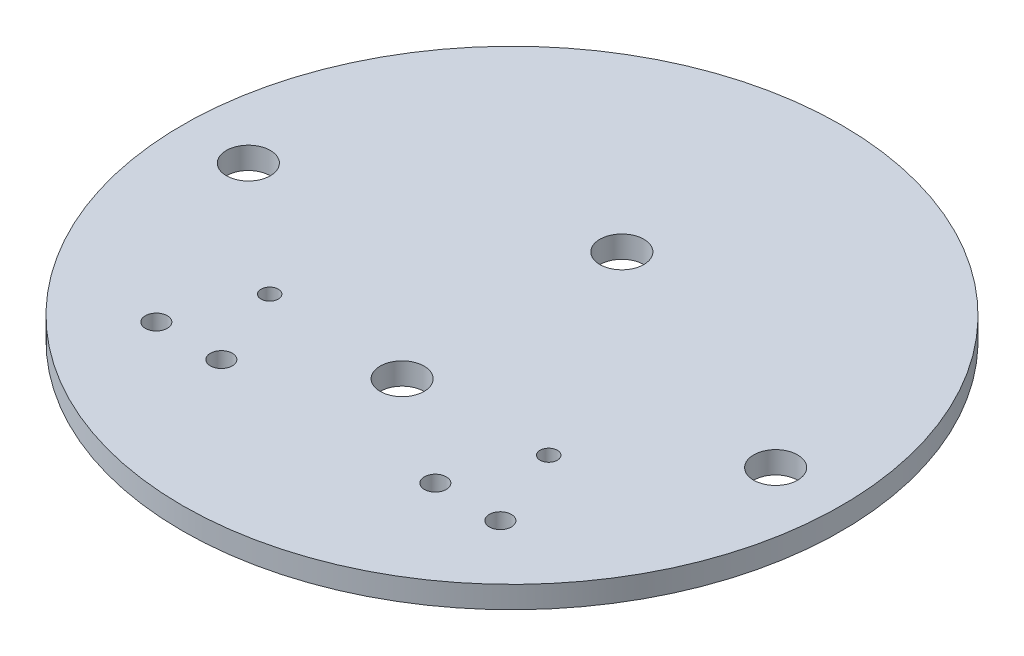
ISO-10303-21;
HEADER;
FILE_DESCRIPTION(('STEP AP214'),'2;1');
FILE_NAME('part.step','',(''),(''),'','','');
FILE_SCHEMA(('AUTOMOTIVE_DESIGN { 1 0 10303 214 1 1 1 1 }'));
ENDSEC;
DATA;
#1=APPLICATION_CONTEXT('core data for automotive mechanical design processes');
#2=APPLICATION_PROTOCOL_DEFINITION('international standard','automotive_design',2000,#1);
#3=PRODUCT_CONTEXT('',#1,'mechanical');
#4=PRODUCT('Part','Part','',(#3));
#5=PRODUCT_RELATED_PRODUCT_CATEGORY('part','',(#4));
#6=PRODUCT_DEFINITION_FORMATION('','',#4);
#7=PRODUCT_DEFINITION_CONTEXT('part definition',#1,'design');
#8=PRODUCT_DEFINITION('design','',#6,#7);
#9=PRODUCT_DEFINITION_SHAPE('','',#8);
#10=(LENGTH_UNIT() NAMED_UNIT(*) SI_UNIT(.MILLI.,.METRE.));
#11=(NAMED_UNIT(*) PLANE_ANGLE_UNIT() SI_UNIT($,.RADIAN.));
#12=(NAMED_UNIT(*) SI_UNIT($,.STERADIAN.) SOLID_ANGLE_UNIT());
#13=UNCERTAINTY_MEASURE_WITH_UNIT(LENGTH_MEASURE(1.E-05),#10,'distance_accuracy_value','');
#14=(GEOMETRIC_REPRESENTATION_CONTEXT(3) GLOBAL_UNCERTAINTY_ASSIGNED_CONTEXT((#13)) GLOBAL_UNIT_ASSIGNED_CONTEXT((#10,
#11,#12)) REPRESENTATION_CONTEXT('',''));
#15=CARTESIAN_POINT('',(0.,0.,0.));
#16=DIRECTION('',(0.,0.,1.));
#17=DIRECTION('',(1.,0.,0.));
#18=AXIS2_PLACEMENT_3D('',#15,#16,#17);
#19=CARTESIAN_POINT('',(0.,3.175,0.));
#20=DIRECTION('',(0.,-1.,0.));
#21=DIRECTION('',(0.,0.,-1.));
#22=AXIS2_PLACEMENT_3D('',#19,#20,#21);
#23=CYLINDRICAL_SURFACE('',#22,47.625);
#24=CARTESIAN_POINT('',(0.,3.175,0.));
#25=DIRECTION('',(0.,1.,0.));
#26=DIRECTION('',(0.,0.,1.));
#27=AXIS2_PLACEMENT_3D('',#24,#25,#26);
#28=CIRCLE('',#27,47.625);
#29=CARTESIAN_POINT('',(0.,3.175,47.625));
#30=VERTEX_POINT('',#29);
#31=EDGE_CURVE('E10',#30,#30,#28,.T.);
#32=ORIENTED_EDGE('',*,*,#31,.F.);
#33=EDGE_LOOP('',(#32));
#34=FACE_BOUND('',#33,.T.);
#35=CARTESIAN_POINT('',(0.,0.,0.));
#36=DIRECTION('',(0.,1.,0.));
#37=DIRECTION('',(0.,0.,1.));
#38=AXIS2_PLACEMENT_3D('',#35,#36,#37);
#39=CIRCLE('',#38,47.625);
#40=CARTESIAN_POINT('',(0.,0.,47.625));
#41=VERTEX_POINT('',#40);
#42=EDGE_CURVE('E37',#41,#41,#39,.T.);
#43=ORIENTED_EDGE('',*,*,#42,.T.);
#44=EDGE_LOOP('',(#43));
#45=FACE_BOUND('',#44,.T.);
#46=ADVANCED_FACE('F30',(#34,#45),#23,.T.);
#47=CARTESIAN_POINT('',(0.,3.175,0.));
#48=DIRECTION('',(0.,1.,0.));
#49=DIRECTION('',(0.,0.,1.));
#50=AXIS2_PLACEMENT_3D('',#47,#48,#49);
#51=PLANE('',#50);
#52=CARTESIAN_POINT('',(-24.86025,3.175,26.5429999999999));
#53=DIRECTION('',(0.,1.,0.));
#54=DIRECTION('',(0.,0.,1.));
#55=AXIS2_PLACEMENT_3D('',#52,#53,#54);
#56=CIRCLE('',#55,1.5875);
#57=CARTESIAN_POINT('',(-24.86025,3.175,28.1304999999999));
#58=VERTEX_POINT('',#57);
#59=EDGE_CURVE('E59',#58,#58,#56,.T.);
#60=ORIENTED_EDGE('',*,*,#59,.F.);
#61=EDGE_LOOP('',(#60));
#62=FACE_BOUND('',#61,.T.);
#63=CARTESIAN_POINT('',(-15.46225,3.175,26.5429999999999));
#64=DIRECTION('',(0.,1.,0.));
#65=DIRECTION('',(0.,0.,1.));
#66=AXIS2_PLACEMENT_3D('',#63,#64,#65);
#67=CIRCLE('',#66,1.5875);
#68=CARTESIAN_POINT('',(-15.46225,3.175,28.1304999999999));
#69=VERTEX_POINT('',#68);
#70=EDGE_CURVE('E80',#69,#69,#67,.T.);
#71=ORIENTED_EDGE('',*,*,#70,.F.);
#72=EDGE_LOOP('',(#71));
#73=FACE_BOUND('',#72,.T.);
#74=CARTESIAN_POINT('',(15.46225,3.175,26.5429999999999));
#75=DIRECTION('',(0.,1.,0.));
#76=DIRECTION('',(0.,0.,1.));
#77=AXIS2_PLACEMENT_3D('',#74,#75,#76);
#78=CIRCLE('',#77,1.5875);
#79=CARTESIAN_POINT('',(15.46225,3.175,28.1304999999999));
#80=VERTEX_POINT('',#79);
#81=EDGE_CURVE('E77',#80,#80,#78,.T.);
#82=ORIENTED_EDGE('',*,*,#81,.F.);
#83=EDGE_LOOP('',(#82));
#84=FACE_BOUND('',#83,.T.);
#85=CARTESIAN_POINT('',(24.86025,3.175,26.5429999999999));
#86=DIRECTION('',(0.,1.,0.));
#87=DIRECTION('',(0.,0.,1.));
#88=AXIS2_PLACEMENT_3D('',#85,#86,#87);
#89=CIRCLE('',#88,1.5875);
#90=CARTESIAN_POINT('',(24.86025,3.175,28.1304999999999));
#91=VERTEX_POINT('',#90);
#92=EDGE_CURVE('E74',#91,#91,#89,.T.);
#93=ORIENTED_EDGE('',*,*,#92,.F.);
#94=EDGE_LOOP('',(#93));
#95=FACE_BOUND('',#94,.T.);
#96=CARTESIAN_POINT('',(20.16125,3.175,14.859));
#97=DIRECTION('',(0.,1.,0.));
#98=DIRECTION('',(0.,0.,1.));
#99=AXIS2_PLACEMENT_3D('',#96,#97,#98);
#100=CIRCLE('',#99,1.25);
#101=CARTESIAN_POINT('',(20.16125,3.175,16.109));
#102=VERTEX_POINT('',#101);
#103=EDGE_CURVE('E70',#102,#102,#100,.T.);
#104=ORIENTED_EDGE('',*,*,#103,.F.);
#105=EDGE_LOOP('',(#104));
#106=FACE_BOUND('',#105,.T.);
#107=CARTESIAN_POINT('',(-20.16125,3.175,14.8589999999999));
#108=DIRECTION('',(0.,1.,0.));
#109=DIRECTION('',(0.,0.,1.));
#110=AXIS2_PLACEMENT_3D('',#107,#108,#109);
#111=CIRCLE('',#110,1.25);
#112=CARTESIAN_POINT('',(-20.16125,3.175,16.1089999999999));
#113=VERTEX_POINT('',#112);
#114=EDGE_CURVE('E66',#113,#113,#111,.T.);
#115=ORIENTED_EDGE('',*,*,#114,.F.);
#116=EDGE_LOOP('',(#115));
#117=FACE_BOUND('',#116,.T.);
#118=CARTESIAN_POINT('',(0.,3.175,15.875));
#119=DIRECTION('',(0.,1.,0.));
#120=DIRECTION('',(0.,0.,1.));
#121=AXIS2_PLACEMENT_3D('',#118,#119,#120);
#122=CIRCLE('',#121,3.175);
#123=CARTESIAN_POINT('',(0.,3.175,19.05));
#124=VERTEX_POINT('',#123);
#125=EDGE_CURVE('E51',#124,#124,#122,.T.);
#126=ORIENTED_EDGE('',*,*,#125,.F.);
#127=EDGE_LOOP('',(#126));
#128=FACE_BOUND('',#127,.T.);
#129=CARTESIAN_POINT('',(0.,3.175,-15.875));
#130=DIRECTION('',(0.,1.,0.));
#131=DIRECTION('',(0.,0.,1.));
#132=AXIS2_PLACEMENT_3D('',#129,#130,#131);
#133=CIRCLE('',#132,3.175);
#134=CARTESIAN_POINT('',(0.,3.175,-12.7));
#135=VERTEX_POINT('',#134);
#136=EDGE_CURVE('E58',#135,#135,#133,.T.);
#137=ORIENTED_EDGE('',*,*,#136,.F.);
#138=EDGE_LOOP('',(#137));
#139=FACE_BOUND('',#138,.T.);
#140=CARTESIAN_POINT('',(38.1,3.175,0.));
#141=DIRECTION('',(0.,1.,0.));
#142=DIRECTION('',(0.,0.,1.));
#143=AXIS2_PLACEMENT_3D('',#140,#141,#142);
#144=CIRCLE('',#143,3.175);
#145=CARTESIAN_POINT('',(38.1,3.175,3.17499999999998));
#146=VERTEX_POINT('',#145);
#147=EDGE_CURVE('E42',#146,#146,#144,.T.);
#148=ORIENTED_EDGE('',*,*,#147,.F.);
#149=EDGE_LOOP('',(#148));
#150=FACE_BOUND('',#149,.T.);
#151=CARTESIAN_POINT('',(-38.1,3.175,0.));
#152=DIRECTION('',(0.,1.,0.));
#153=DIRECTION('',(0.,0.,1.));
#154=AXIS2_PLACEMENT_3D('',#151,#152,#153);
#155=CIRCLE('',#154,3.175);
#156=CARTESIAN_POINT('',(-38.1,3.175,3.17500000000001));
#157=VERTEX_POINT('',#156);
#158=EDGE_CURVE('E50',#157,#157,#155,.T.);
#159=ORIENTED_EDGE('',*,*,#158,.F.);
#160=EDGE_LOOP('',(#159));
#161=FACE_BOUND('',#160,.T.);
#162=ORIENTED_EDGE('',*,*,#31,.T.);
#163=EDGE_LOOP('',(#162));
#164=FACE_BOUND('',#163,.T.);
#165=ADVANCED_FACE('F103',(#62,#73,#84,#95,#106,#117,#128,#139,#150,#161,#164),#51,.T.);
#166=CARTESIAN_POINT('',(0.,0.,0.));
#167=DIRECTION('',(0.,1.,0.));
#168=DIRECTION('',(0.,0.,1.));
#169=AXIS2_PLACEMENT_3D('',#166,#167,#168);
#170=PLANE('',#169);
#171=CARTESIAN_POINT('',(-24.86025,0.,26.5429999999999));
#172=DIRECTION('',(0.,1.,0.));
#173=DIRECTION('',(0.,0.,1.));
#174=AXIS2_PLACEMENT_3D('',#171,#172,#173);
#175=CIRCLE('',#174,1.5875);
#176=CARTESIAN_POINT('',(-24.86025,0.,28.1304999999999));
#177=VERTEX_POINT('',#176);
#178=EDGE_CURVE('E33',#177,#177,#175,.T.);
#179=ORIENTED_EDGE('',*,*,#178,.T.);
#180=EDGE_LOOP('',(#179));
#181=FACE_BOUND('',#180,.T.);
#182=CARTESIAN_POINT('',(-15.46225,0.,26.5429999999999));
#183=DIRECTION('',(0.,1.,0.));
#184=DIRECTION('',(0.,0.,1.));
#185=AXIS2_PLACEMENT_3D('',#182,#183,#184);
#186=CIRCLE('',#185,1.5875);
#187=CARTESIAN_POINT('',(-15.46225,0.,28.1304999999999));
#188=VERTEX_POINT('',#187);
#189=EDGE_CURVE('E78',#188,#188,#186,.T.);
#190=ORIENTED_EDGE('',*,*,#189,.T.);
#191=EDGE_LOOP('',(#190));
#192=FACE_BOUND('',#191,.T.);
#193=CARTESIAN_POINT('',(15.46225,0.,26.5429999999999));
#194=DIRECTION('',(0.,1.,0.));
#195=DIRECTION('',(0.,0.,1.));
#196=AXIS2_PLACEMENT_3D('',#193,#194,#195);
#197=CIRCLE('',#196,1.5875);
#198=CARTESIAN_POINT('',(15.46225,0.,28.1304999999999));
#199=VERTEX_POINT('',#198);
#200=EDGE_CURVE('E75',#199,#199,#197,.T.);
#201=ORIENTED_EDGE('',*,*,#200,.T.);
#202=EDGE_LOOP('',(#201));
#203=FACE_BOUND('',#202,.T.);
#204=CARTESIAN_POINT('',(24.86025,0.,26.5429999999999));
#205=DIRECTION('',(0.,1.,0.));
#206=DIRECTION('',(0.,0.,1.));
#207=AXIS2_PLACEMENT_3D('',#204,#205,#206);
#208=CIRCLE('',#207,1.5875);
#209=CARTESIAN_POINT('',(24.86025,0.,28.1304999999999));
#210=VERTEX_POINT('',#209);
#211=EDGE_CURVE('E71',#210,#210,#208,.T.);
#212=ORIENTED_EDGE('',*,*,#211,.T.);
#213=EDGE_LOOP('',(#212));
#214=FACE_BOUND('',#213,.T.);
#215=CARTESIAN_POINT('',(20.16125,0.,14.859));
#216=DIRECTION('',(0.,1.,0.));
#217=DIRECTION('',(0.,0.,1.));
#218=AXIS2_PLACEMENT_3D('',#215,#216,#217);
#219=CIRCLE('',#218,1.25);
#220=CARTESIAN_POINT('',(20.16125,0.,16.109));
#221=VERTEX_POINT('',#220);
#222=EDGE_CURVE('E67',#221,#221,#219,.T.);
#223=ORIENTED_EDGE('',*,*,#222,.T.);
#224=EDGE_LOOP('',(#223));
#225=FACE_BOUND('',#224,.T.);
#226=CARTESIAN_POINT('',(-20.16125,0.,14.8589999999999));
#227=DIRECTION('',(0.,1.,0.));
#228=DIRECTION('',(0.,0.,1.));
#229=AXIS2_PLACEMENT_3D('',#226,#227,#228);
#230=CIRCLE('',#229,1.25);
#231=CARTESIAN_POINT('',(-20.16125,0.,16.1089999999999));
#232=VERTEX_POINT('',#231);
#233=EDGE_CURVE('E63',#232,#232,#230,.T.);
#234=ORIENTED_EDGE('',*,*,#233,.T.);
#235=EDGE_LOOP('',(#234));
#236=FACE_BOUND('',#235,.T.);
#237=CARTESIAN_POINT('',(0.,0.,15.875));
#238=DIRECTION('',(0.,1.,0.));
#239=DIRECTION('',(0.,0.,1.));
#240=AXIS2_PLACEMENT_3D('',#237,#238,#239);
#241=CIRCLE('',#240,3.175);
#242=CARTESIAN_POINT('',(0.,0.,19.05));
#243=VERTEX_POINT('',#242);
#244=EDGE_CURVE('E60',#243,#243,#241,.T.);
#245=ORIENTED_EDGE('',*,*,#244,.T.);
#246=EDGE_LOOP('',(#245));
#247=FACE_BOUND('',#246,.T.);
#248=CARTESIAN_POINT('',(0.,0.,-15.875));
#249=DIRECTION('',(0.,1.,0.));
#250=DIRECTION('',(0.,0.,1.));
#251=AXIS2_PLACEMENT_3D('',#248,#249,#250);
#252=CIRCLE('',#251,3.175);
#253=CARTESIAN_POINT('',(0.,0.,-12.7));
#254=VERTEX_POINT('',#253);
#255=EDGE_CURVE('E55',#254,#254,#252,.T.);
#256=ORIENTED_EDGE('',*,*,#255,.T.);
#257=EDGE_LOOP('',(#256));
#258=FACE_BOUND('',#257,.T.);
#259=CARTESIAN_POINT('',(38.1,0.,0.));
#260=DIRECTION('',(0.,1.,0.));
#261=DIRECTION('',(0.,0.,1.));
#262=AXIS2_PLACEMENT_3D('',#259,#260,#261);
#263=CIRCLE('',#262,3.175);
#264=CARTESIAN_POINT('',(38.1,0.,3.17499999999998));
#265=VERTEX_POINT('',#264);
#266=EDGE_CURVE('E52',#265,#265,#263,.T.);
#267=ORIENTED_EDGE('',*,*,#266,.T.);
#268=EDGE_LOOP('',(#267));
#269=FACE_BOUND('',#268,.T.);
#270=CARTESIAN_POINT('',(-38.1,0.,0.));
#271=DIRECTION('',(0.,1.,0.));
#272=DIRECTION('',(0.,0.,1.));
#273=AXIS2_PLACEMENT_3D('',#270,#271,#272);
#274=CIRCLE('',#273,3.175);
#275=CARTESIAN_POINT('',(-38.1,0.,3.17500000000001));
#276=VERTEX_POINT('',#275);
#277=EDGE_CURVE('E47',#276,#276,#274,.T.);
#278=ORIENTED_EDGE('',*,*,#277,.T.);
#279=EDGE_LOOP('',(#278));
#280=FACE_BOUND('',#279,.T.);
#281=ORIENTED_EDGE('',*,*,#42,.F.);
#282=EDGE_LOOP('',(#281));
#283=FACE_BOUND('',#282,.T.);
#284=ADVANCED_FACE('F105',(#181,#192,#203,#214,#225,#236,#247,#258,#269,#280,#283),#170,.F.);
#285=CARTESIAN_POINT('',(-38.1,-31.623,0.));
#286=DIRECTION('',(0.,1.,0.));
#287=DIRECTION('',(0.,0.,1.));
#288=AXIS2_PLACEMENT_3D('',#285,#286,#287);
#289=CYLINDRICAL_SURFACE('',#288,3.175);
#290=ORIENTED_EDGE('',*,*,#158,.T.);
#291=EDGE_LOOP('',(#290));
#292=FACE_BOUND('',#291,.T.);
#293=ORIENTED_EDGE('',*,*,#277,.F.);
#294=EDGE_LOOP('',(#293));
#295=FACE_BOUND('',#294,.T.);
#296=ADVANCED_FACE('F100',(#292,#295),#289,.F.);
#297=CARTESIAN_POINT('',(38.1,-31.623,0.));
#298=DIRECTION('',(0.,1.,0.));
#299=DIRECTION('',(0.,0.,1.));
#300=AXIS2_PLACEMENT_3D('',#297,#298,#299);
#301=CYLINDRICAL_SURFACE('',#300,3.175);
#302=ORIENTED_EDGE('',*,*,#147,.T.);
#303=EDGE_LOOP('',(#302));
#304=FACE_BOUND('',#303,.T.);
#305=ORIENTED_EDGE('',*,*,#266,.F.);
#306=EDGE_LOOP('',(#305));
#307=FACE_BOUND('',#306,.T.);
#308=ADVANCED_FACE('F120',(#304,#307),#301,.F.);
#309=CARTESIAN_POINT('',(0.,22.225,-15.875));
#310=DIRECTION('',(0.,-1.,0.));
#311=DIRECTION('',(0.,0.,-1.));
#312=AXIS2_PLACEMENT_3D('',#309,#310,#311);
#313=CYLINDRICAL_SURFACE('',#312,3.175);
#314=ORIENTED_EDGE('',*,*,#136,.T.);
#315=EDGE_LOOP('',(#314));
#316=FACE_BOUND('',#315,.T.);
#317=ORIENTED_EDGE('',*,*,#255,.F.);
#318=EDGE_LOOP('',(#317));
#319=FACE_BOUND('',#318,.T.);
#320=ADVANCED_FACE('F123',(#316,#319),#313,.F.);
#321=CARTESIAN_POINT('',(0.,22.225,15.875));
#322=DIRECTION('',(0.,-1.,0.));
#323=DIRECTION('',(0.,0.,-1.));
#324=AXIS2_PLACEMENT_3D('',#321,#322,#323);
#325=CYLINDRICAL_SURFACE('',#324,3.175);
#326=ORIENTED_EDGE('',*,*,#125,.T.);
#327=EDGE_LOOP('',(#326));
#328=FACE_BOUND('',#327,.T.);
#329=ORIENTED_EDGE('',*,*,#244,.F.);
#330=EDGE_LOOP('',(#329));
#331=FACE_BOUND('',#330,.T.);
#332=ADVANCED_FACE('F127',(#328,#331),#325,.F.);
#333=CARTESIAN_POINT('',(-20.16125,47.625,14.8589999999999));
#334=DIRECTION('',(0.,-1.,0.));
#335=DIRECTION('',(0.,0.,-1.));
#336=AXIS2_PLACEMENT_3D('',#333,#334,#335);
#337=CYLINDRICAL_SURFACE('',#336,1.25);
#338=ORIENTED_EDGE('',*,*,#114,.T.);
#339=EDGE_LOOP('',(#338));
#340=FACE_BOUND('',#339,.T.);
#341=ORIENTED_EDGE('',*,*,#233,.F.);
#342=EDGE_LOOP('',(#341));
#343=FACE_BOUND('',#342,.T.);
#344=ADVANCED_FACE('F131',(#340,#343),#337,.F.);
#345=CARTESIAN_POINT('',(20.16125,47.625,14.859));
#346=DIRECTION('',(0.,-1.,0.));
#347=DIRECTION('',(0.,0.,-1.));
#348=AXIS2_PLACEMENT_3D('',#345,#346,#347);
#349=CYLINDRICAL_SURFACE('',#348,1.25);
#350=ORIENTED_EDGE('',*,*,#103,.T.);
#351=EDGE_LOOP('',(#350));
#352=FACE_BOUND('',#351,.T.);
#353=ORIENTED_EDGE('',*,*,#222,.F.);
#354=EDGE_LOOP('',(#353));
#355=FACE_BOUND('',#354,.T.);
#356=ADVANCED_FACE('F135',(#352,#355),#349,.F.);
#357=CARTESIAN_POINT('',(24.86025,47.625,26.5429999999999));
#358=DIRECTION('',(0.,-1.,0.));
#359=DIRECTION('',(0.,0.,-1.));
#360=AXIS2_PLACEMENT_3D('',#357,#358,#359);
#361=CYLINDRICAL_SURFACE('',#360,1.5875);
#362=ORIENTED_EDGE('',*,*,#92,.T.);
#363=EDGE_LOOP('',(#362));
#364=FACE_BOUND('',#363,.T.);
#365=ORIENTED_EDGE('',*,*,#211,.F.);
#366=EDGE_LOOP('',(#365));
#367=FACE_BOUND('',#366,.T.);
#368=ADVANCED_FACE('F139',(#364,#367),#361,.F.);
#369=CARTESIAN_POINT('',(15.46225,47.625,26.5429999999999));
#370=DIRECTION('',(0.,-1.,0.));
#371=DIRECTION('',(0.,0.,-1.));
#372=AXIS2_PLACEMENT_3D('',#369,#370,#371);
#373=CYLINDRICAL_SURFACE('',#372,1.5875);
#374=ORIENTED_EDGE('',*,*,#81,.T.);
#375=EDGE_LOOP('',(#374));
#376=FACE_BOUND('',#375,.T.);
#377=ORIENTED_EDGE('',*,*,#200,.F.);
#378=EDGE_LOOP('',(#377));
#379=FACE_BOUND('',#378,.T.);
#380=ADVANCED_FACE('F143',(#376,#379),#373,.F.);
#381=CARTESIAN_POINT('',(-15.46225,47.625,26.5429999999999));
#382=DIRECTION('',(0.,-1.,0.));
#383=DIRECTION('',(0.,0.,-1.));
#384=AXIS2_PLACEMENT_3D('',#381,#382,#383);
#385=CYLINDRICAL_SURFACE('',#384,1.5875);
#386=ORIENTED_EDGE('',*,*,#70,.T.);
#387=EDGE_LOOP('',(#386));
#388=FACE_BOUND('',#387,.T.);
#389=ORIENTED_EDGE('',*,*,#189,.F.);
#390=EDGE_LOOP('',(#389));
#391=FACE_BOUND('',#390,.T.);
#392=ADVANCED_FACE('F147',(#388,#391),#385,.F.);
#393=CARTESIAN_POINT('',(-24.86025,47.625,26.5429999999999));
#394=DIRECTION('',(0.,-1.,0.));
#395=DIRECTION('',(0.,0.,-1.));
#396=AXIS2_PLACEMENT_3D('',#393,#394,#395);
#397=CYLINDRICAL_SURFACE('',#396,1.5875);
#398=ORIENTED_EDGE('',*,*,#59,.T.);
#399=EDGE_LOOP('',(#398));
#400=FACE_BOUND('',#399,.T.);
#401=ORIENTED_EDGE('',*,*,#178,.F.);
#402=EDGE_LOOP('',(#401));
#403=FACE_BOUND('',#402,.T.);
#404=ADVANCED_FACE('F150',(#400,#403),#397,.F.);
#405=CLOSED_SHELL('',(#46,#165,#284,#296,#308,#320,#332,#344,#356,#368,#380,#392,#404));
#406=MANIFOLD_SOLID_BREP('B2',#405);
#407=ADVANCED_BREP_SHAPE_REPRESENTATION('',(#18,#406),#14);
#408=SHAPE_DEFINITION_REPRESENTATION(#9,#407);
ENDSEC;
END-ISO-10303-21;
